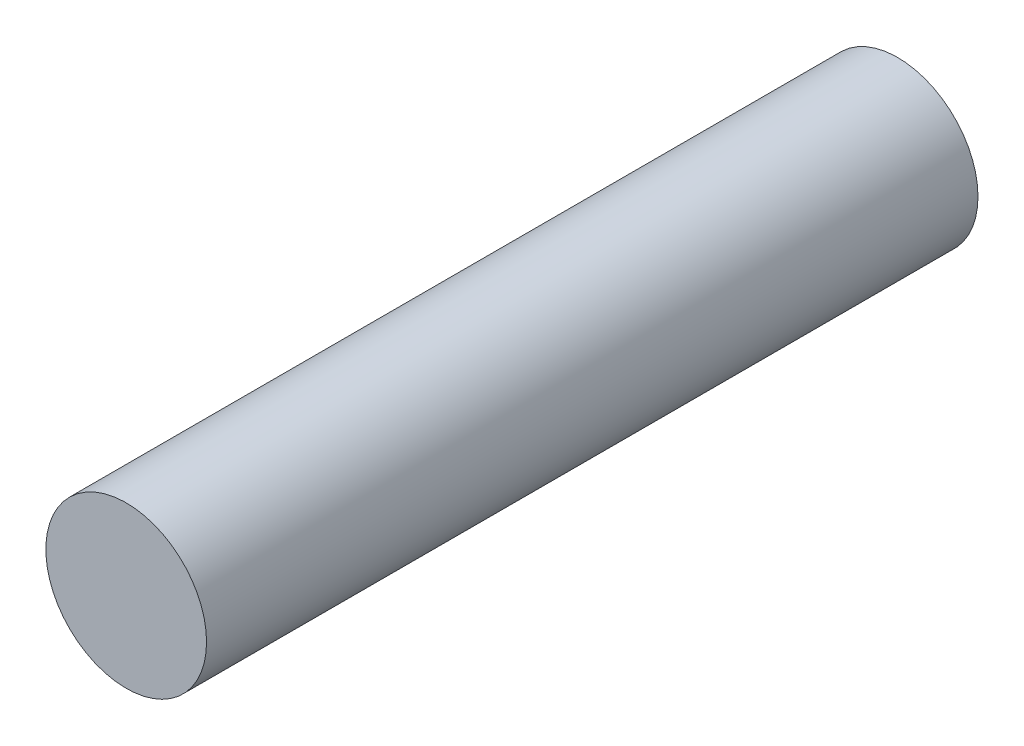
ISO-10303-21;
HEADER;
FILE_DESCRIPTION(('STEP AP214'),'2;1');
FILE_NAME('part.step','',(''),(''),'','','');
FILE_SCHEMA(('AUTOMOTIVE_DESIGN { 1 0 10303 214 1 1 1 1 }'));
ENDSEC;
DATA;
#1=APPLICATION_CONTEXT('core data for automotive mechanical design processes');
#2=APPLICATION_PROTOCOL_DEFINITION('international standard','automotive_design',2000,#1);
#3=PRODUCT_CONTEXT('',#1,'mechanical');
#4=PRODUCT('Part','Part','',(#3));
#5=PRODUCT_RELATED_PRODUCT_CATEGORY('part','',(#4));
#6=PRODUCT_DEFINITION_FORMATION('','',#4);
#7=PRODUCT_DEFINITION_CONTEXT('part definition',#1,'design');
#8=PRODUCT_DEFINITION('design','',#6,#7);
#9=PRODUCT_DEFINITION_SHAPE('','',#8);
#10=(LENGTH_UNIT() NAMED_UNIT(*) SI_UNIT(.MILLI.,.METRE.));
#11=(NAMED_UNIT(*) PLANE_ANGLE_UNIT() SI_UNIT($,.RADIAN.));
#12=(NAMED_UNIT(*) SI_UNIT($,.STERADIAN.) SOLID_ANGLE_UNIT());
#13=UNCERTAINTY_MEASURE_WITH_UNIT(LENGTH_MEASURE(1.E-05),#10,'distance_accuracy_value','');
#14=(GEOMETRIC_REPRESENTATION_CONTEXT(3) GLOBAL_UNCERTAINTY_ASSIGNED_CONTEXT((#13)) GLOBAL_UNIT_ASSIGNED_CONTEXT((#10,
#11,#12)) REPRESENTATION_CONTEXT('',''));
#15=CARTESIAN_POINT('',(0.,0.,0.));
#16=DIRECTION('',(0.,0.,1.));
#17=DIRECTION('',(1.,0.,0.));
#18=AXIS2_PLACEMENT_3D('',#15,#16,#17);
#19=CARTESIAN_POINT('',(0.,0.,72.));
#20=DIRECTION('',(0.,0.,-1.));
#21=DIRECTION('',(-1.,0.,0.));
#22=AXIS2_PLACEMENT_3D('',#19,#20,#21);
#23=CYLINDRICAL_SURFACE('',#22,7.5);
#24=CARTESIAN_POINT('',(0.,0.,72.));
#25=DIRECTION('',(0.,0.,1.));
#26=DIRECTION('',(1.,0.,0.));
#27=AXIS2_PLACEMENT_3D('',#24,#25,#26);
#28=CIRCLE('',#27,7.5);
#29=CARTESIAN_POINT('',(7.5,0.,72.));
#30=VERTEX_POINT('',#29);
#31=EDGE_CURVE('E10',#30,#30,#28,.T.);
#32=ORIENTED_EDGE('',*,*,#31,.F.);
#33=EDGE_LOOP('',(#32));
#34=FACE_BOUND('',#33,.T.);
#35=CARTESIAN_POINT('',(0.,0.,0.));
#36=DIRECTION('',(0.,0.,1.));
#37=DIRECTION('',(1.,0.,0.));
#38=AXIS2_PLACEMENT_3D('',#35,#36,#37);
#39=CIRCLE('',#38,7.5);
#40=CARTESIAN_POINT('',(7.5,0.,0.));
#41=VERTEX_POINT('',#40);
#42=EDGE_CURVE('E44',#41,#41,#39,.T.);
#43=ORIENTED_EDGE('',*,*,#42,.T.);
#44=EDGE_LOOP('',(#43));
#45=FACE_BOUND('',#44,.T.);
#46=ADVANCED_FACE('F41',(#34,#45),#23,.T.);
#47=CARTESIAN_POINT('',(0.,0.,72.));
#48=DIRECTION('',(0.,0.,1.));
#49=DIRECTION('',(1.,0.,0.));
#50=AXIS2_PLACEMENT_3D('',#47,#48,#49);
#51=PLANE('',#50);
#52=ORIENTED_EDGE('',*,*,#31,.T.);
#53=EDGE_LOOP('',(#52));
#54=FACE_BOUND('',#53,.T.);
#55=ADVANCED_FACE('F58',(#54),#51,.T.);
#56=CARTESIAN_POINT('',(0.,0.,0.));
#57=DIRECTION('',(0.,0.,1.));
#58=DIRECTION('',(1.,0.,0.));
#59=AXIS2_PLACEMENT_3D('',#56,#57,#58);
#60=PLANE('',#59);
#61=ORIENTED_EDGE('',*,*,#42,.F.);
#62=EDGE_LOOP('',(#61));
#63=FACE_BOUND('',#62,.T.);
#64=ADVANCED_FACE('F56',(#63),#60,.F.);
#65=CLOSED_SHELL('',(#46,#55,#64));
#66=MANIFOLD_SOLID_BREP('B2',#65);
#67=ADVANCED_BREP_SHAPE_REPRESENTATION('',(#18,#66),#14);
#68=SHAPE_DEFINITION_REPRESENTATION(#9,#67);
ENDSEC;
END-ISO-10303-21;
